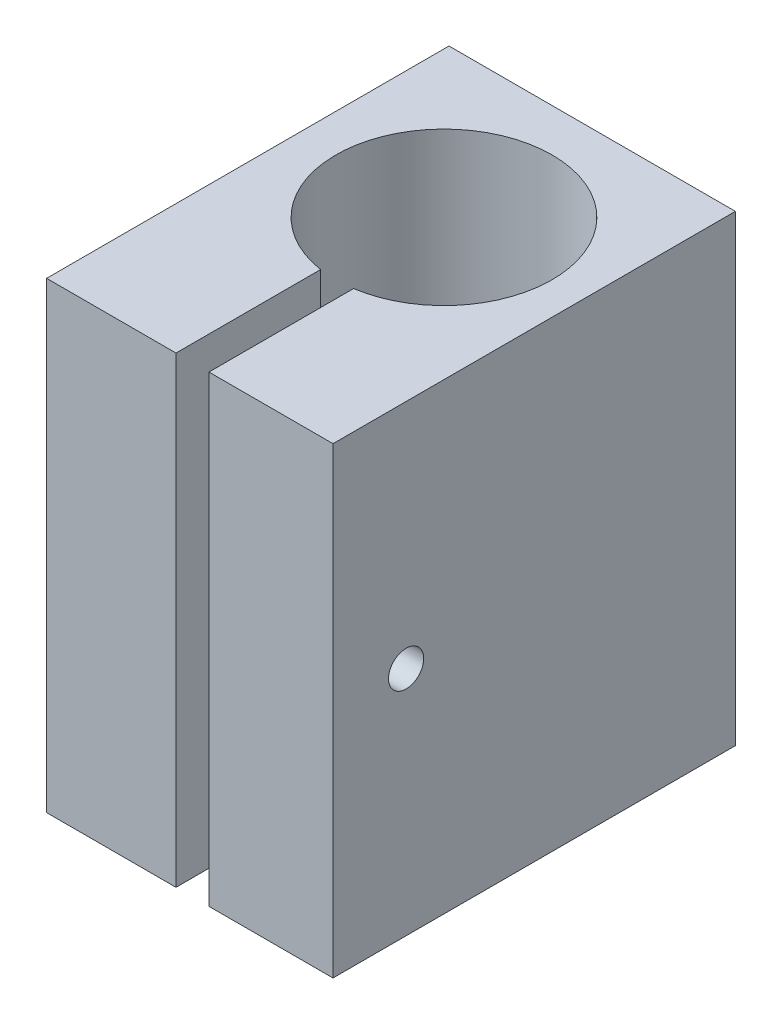
ISO-10303-21;
HEADER;
FILE_DESCRIPTION(('STEP AP214'),'2;1');
FILE_NAME('part.step','',(''),(''),'','','');
FILE_SCHEMA(('AUTOMOTIVE_DESIGN { 1 0 10303 214 1 1 1 1 }'));
ENDSEC;
DATA;
#1=APPLICATION_CONTEXT('core data for automotive mechanical design processes');
#2=APPLICATION_PROTOCOL_DEFINITION('international standard','automotive_design',2000,#1);
#3=PRODUCT_CONTEXT('',#1,'mechanical');
#4=PRODUCT('Part','Part','',(#3));
#5=PRODUCT_RELATED_PRODUCT_CATEGORY('part','',(#4));
#6=PRODUCT_DEFINITION_FORMATION('','',#4);
#7=PRODUCT_DEFINITION_CONTEXT('part definition',#1,'design');
#8=PRODUCT_DEFINITION('design','',#6,#7);
#9=PRODUCT_DEFINITION_SHAPE('','',#8);
#10=(LENGTH_UNIT() NAMED_UNIT(*) SI_UNIT(.MILLI.,.METRE.));
#11=(NAMED_UNIT(*) PLANE_ANGLE_UNIT() SI_UNIT($,.RADIAN.));
#12=(NAMED_UNIT(*) SI_UNIT($,.STERADIAN.) SOLID_ANGLE_UNIT());
#13=UNCERTAINTY_MEASURE_WITH_UNIT(LENGTH_MEASURE(1.E-05),#10,'distance_accuracy_value','');
#14=(GEOMETRIC_REPRESENTATION_CONTEXT(3) GLOBAL_UNCERTAINTY_ASSIGNED_CONTEXT((#13)) GLOBAL_UNIT_ASSIGNED_CONTEXT((#10,
#11,#12)) REPRESENTATION_CONTEXT('',''));
#15=CARTESIAN_POINT('',(0.,0.,0.));
#16=DIRECTION('',(0.,0.,1.));
#17=DIRECTION('',(1.,0.,0.));
#18=AXIS2_PLACEMENT_3D('',#15,#16,#17);
#19=CARTESIAN_POINT('',(1.90309523809524,46.,20.));
#20=DIRECTION('',(0.,0.,-1.));
#21=DIRECTION('',(-1.,0.,0.));
#22=AXIS2_PLACEMENT_3D('',#19,#20,#21);
#23=PLANE('',#22);
#24=DIRECTION('',(1.,0.,0.));
#25=VECTOR('',#24,1.);
#26=CARTESIAN_POINT('',(1.90309523809524,0.,20.));
#27=LINE('',#26,#25);
#28=CARTESIAN_POINT('',(1.90309523809524,0.,20.));
#29=VERTEX_POINT('',#28);
#30=CARTESIAN_POINT('',(14.235,0.,20.));
#31=VERTEX_POINT('',#30);
#32=EDGE_CURVE('E146',#29,#31,#27,.T.);
#33=ORIENTED_EDGE('',*,*,#32,.T.);
#34=DIRECTION('',(0.,-1.,0.));
#35=VECTOR('',#34,1.);
#36=CARTESIAN_POINT('',(14.235,46.,20.));
#37=LINE('',#36,#35);
#38=CARTESIAN_POINT('',(14.235,46.,20.));
#39=VERTEX_POINT('',#38);
#40=EDGE_CURVE('E11',#39,#31,#37,.T.);
#41=ORIENTED_EDGE('',*,*,#40,.F.);
#42=DIRECTION('',(1.,0.,0.));
#43=VECTOR('',#42,1.);
#44=CARTESIAN_POINT('',(1.90309523809524,46.,20.));
#45=LINE('',#44,#43);
#46=CARTESIAN_POINT('',(1.90309523809524,46.,20.));
#47=VERTEX_POINT('',#46);
#48=EDGE_CURVE('E162',#47,#39,#45,.T.);
#49=ORIENTED_EDGE('',*,*,#48,.F.);
#50=DIRECTION('',(0.,-1.,0.));
#51=VECTOR('',#50,1.);
#52=CARTESIAN_POINT('',(1.90309523809524,46.,20.));
#53=LINE('',#52,#51);
#54=EDGE_CURVE('E142',#47,#29,#53,.T.);
#55=ORIENTED_EDGE('',*,*,#54,.T.);
#56=EDGE_LOOP('',(#33,#41,#49,#55));
#57=FACE_BOUND('',#56,.T.);
#58=ADVANCED_FACE('F37',(#57),#23,.F.);
#59=CARTESIAN_POINT('',(14.235,46.,-20.));
#60=DIRECTION('',(-1.,0.,0.));
#61=DIRECTION('',(0.,0.,1.));
#62=AXIS2_PLACEMENT_3D('',#59,#60,#61);
#63=PLANE('',#62);
#64=CARTESIAN_POINT('',(14.235,23.,12.7330134340511));
#65=DIRECTION('',(-1.,0.,0.));
#66=DIRECTION('',(0.,0.,1.));
#67=AXIS2_PLACEMENT_3D('',#64,#65,#66);
#68=CIRCLE('',#67,1.75);
#69=CARTESIAN_POINT('',(14.235,23.,14.4830134340511));
#70=VERTEX_POINT('',#69);
#71=EDGE_CURVE('E251',#70,#70,#68,.T.);
#72=ORIENTED_EDGE('',*,*,#71,.T.);
#73=EDGE_LOOP('',(#72));
#74=FACE_BOUND('',#73,.T.);
#75=DIRECTION('',(0.,0.,-1.));
#76=VECTOR('',#75,1.);
#77=CARTESIAN_POINT('',(14.235,0.,-20.));
#78=LINE('',#77,#76);
#79=CARTESIAN_POINT('',(14.235,0.,-20.));
#80=VERTEX_POINT('',#79);
#81=EDGE_CURVE('E149',#31,#80,#78,.T.);
#82=ORIENTED_EDGE('',*,*,#81,.T.);
#83=DIRECTION('',(0.,-1.,0.));
#84=VECTOR('',#83,1.);
#85=CARTESIAN_POINT('',(14.235,46.,-20.));
#86=LINE('',#85,#84);
#87=CARTESIAN_POINT('',(14.235,46.,-20.));
#88=VERTEX_POINT('',#87);
#89=EDGE_CURVE('E45',#88,#80,#86,.T.);
#90=ORIENTED_EDGE('',*,*,#89,.F.);
#91=DIRECTION('',(0.,0.,-1.));
#92=VECTOR('',#91,1.);
#93=CARTESIAN_POINT('',(14.235,46.,-20.));
#94=LINE('',#93,#92);
#95=EDGE_CURVE('E102',#39,#88,#94,.T.);
#96=ORIENTED_EDGE('',*,*,#95,.F.);
#97=ORIENTED_EDGE('',*,*,#40,.T.);
#98=EDGE_LOOP('',(#82,#90,#96,#97));
#99=FACE_BOUND('',#98,.T.);
#100=ADVANCED_FACE('F275',(#74,#99),#63,.F.);
#101=CARTESIAN_POINT('',(-14.235,46.,-20.));
#102=DIRECTION('',(0.,0.,1.));
#103=DIRECTION('',(1.,0.,0.));
#104=AXIS2_PLACEMENT_3D('',#101,#102,#103);
#105=PLANE('',#104);
#106=DIRECTION('',(-1.,0.,0.));
#107=VECTOR('',#106,1.);
#108=CARTESIAN_POINT('',(-14.235,0.,-20.));
#109=LINE('',#108,#107);
#110=CARTESIAN_POINT('',(-14.235,0.,-20.));
#111=VERTEX_POINT('',#110);
#112=EDGE_CURVE('E152',#80,#111,#109,.T.);
#113=ORIENTED_EDGE('',*,*,#112,.T.);
#114=DIRECTION('',(0.,-1.,0.));
#115=VECTOR('',#114,1.);
#116=CARTESIAN_POINT('',(-14.235,46.,-20.));
#117=LINE('',#116,#115);
#118=CARTESIAN_POINT('',(-14.235,46.,-20.));
#119=VERTEX_POINT('',#118);
#120=EDGE_CURVE('E169',#119,#111,#117,.T.);
#121=ORIENTED_EDGE('',*,*,#120,.F.);
#122=DIRECTION('',(-1.,0.,0.));
#123=VECTOR('',#122,1.);
#124=CARTESIAN_POINT('',(-14.235,46.,-20.));
#125=LINE('',#124,#123);
#126=EDGE_CURVE('E178',#88,#119,#125,.T.);
#127=ORIENTED_EDGE('',*,*,#126,.F.);
#128=ORIENTED_EDGE('',*,*,#89,.T.);
#129=EDGE_LOOP('',(#113,#121,#127,#128));
#130=FACE_BOUND('',#129,.T.);
#131=ADVANCED_FACE('F176',(#130),#105,.F.);
#132=CARTESIAN_POINT('',(-14.235,46.,-20.));
#133=DIRECTION('',(1.,0.,0.));
#134=DIRECTION('',(0.,0.,-1.));
#135=AXIS2_PLACEMENT_3D('',#132,#133,#134);
#136=PLANE('',#135);
#137=DIRECTION('',(0.,0.5,0.866025403784438));
#138=VECTOR('',#137,1.);
#139=CARTESIAN_POINT('',(-14.235,19.75,12.7330134340511));
#140=LINE('',#139,#138);
#141=CARTESIAN_POINT('',(-14.235,19.75,12.7330134340511));
#142=VERTEX_POINT('',#141);
#143=CARTESIAN_POINT('',(-14.235,21.375,15.5475959963505));
#144=VERTEX_POINT('',#143);
#145=EDGE_CURVE('E225',#142,#144,#140,.T.);
#146=ORIENTED_EDGE('',*,*,#145,.F.);
#147=DIRECTION('',(0.,-0.500000000000001,0.866025403784438));
#148=VECTOR('',#147,1.);
#149=CARTESIAN_POINT('',(-14.235,21.375,9.91843087175167));
#150=LINE('',#149,#148);
#151=CARTESIAN_POINT('',(-14.235,21.375,9.91843087175167));
#152=VERTEX_POINT('',#151);
#153=EDGE_CURVE('E52',#152,#142,#150,.T.);
#154=ORIENTED_EDGE('',*,*,#153,.F.);
#155=DIRECTION('',(0.,-1.,0.));
#156=VECTOR('',#155,1.);
#157=CARTESIAN_POINT('',(-14.235,24.625,9.91843087175167));
#158=LINE('',#157,#156);
#159=CARTESIAN_POINT('',(-14.235,24.625,9.91843087175167));
#160=VERTEX_POINT('',#159);
#161=EDGE_CURVE('E212',#160,#152,#158,.T.);
#162=ORIENTED_EDGE('',*,*,#161,.F.);
#163=DIRECTION('',(0.,-0.5,-0.866025403784439));
#164=VECTOR('',#163,1.);
#165=CARTESIAN_POINT('',(-14.235,26.25,12.7330134340511));
#166=LINE('',#165,#164);
#167=CARTESIAN_POINT('',(-14.235,26.25,12.7330134340511));
#168=VERTEX_POINT('',#167);
#169=EDGE_CURVE('E216',#168,#160,#166,.T.);
#170=ORIENTED_EDGE('',*,*,#169,.F.);
#171=DIRECTION('',(0.,0.5,-0.866025403784438));
#172=VECTOR('',#171,1.);
#173=CARTESIAN_POINT('',(-14.235,24.625,15.5475959963505));
#174=LINE('',#173,#172);
#175=CARTESIAN_POINT('',(-14.235,24.625,15.5475959963505));
#176=VERTEX_POINT('',#175);
#177=EDGE_CURVE('E219',#176,#168,#174,.T.);
#178=ORIENTED_EDGE('',*,*,#177,.F.);
#179=DIRECTION('',(0.,1.,0.));
#180=VECTOR('',#179,1.);
#181=CARTESIAN_POINT('',(-14.235,21.375,15.5475959963505));
#182=LINE('',#181,#180);
#183=EDGE_CURVE('E222',#144,#176,#182,.T.);
#184=ORIENTED_EDGE('',*,*,#183,.F.);
#185=EDGE_LOOP('',(#146,#154,#162,#170,#178,#184));
#186=FACE_BOUND('',#185,.T.);
#187=DIRECTION('',(0.,0.,1.));
#188=VECTOR('',#187,1.);
#189=CARTESIAN_POINT('',(-14.235,0.,-20.));
#190=LINE('',#189,#188);
#191=CARTESIAN_POINT('',(-14.235,0.,20.));
#192=VERTEX_POINT('',#191);
#193=EDGE_CURVE('E154',#111,#192,#190,.T.);
#194=ORIENTED_EDGE('',*,*,#193,.T.);
#195=DIRECTION('',(0.,-1.,0.));
#196=VECTOR('',#195,1.);
#197=CARTESIAN_POINT('',(-14.235,46.,20.));
#198=LINE('',#197,#196);
#199=CARTESIAN_POINT('',(-14.235,46.,20.));
#200=VERTEX_POINT('',#199);
#201=EDGE_CURVE('E166',#200,#192,#198,.T.);
#202=ORIENTED_EDGE('',*,*,#201,.F.);
#203=DIRECTION('',(0.,0.,1.));
#204=VECTOR('',#203,1.);
#205=CARTESIAN_POINT('',(-14.235,46.,-20.));
#206=LINE('',#205,#204);
#207=EDGE_CURVE('E190',#119,#200,#206,.T.);
#208=ORIENTED_EDGE('',*,*,#207,.F.);
#209=ORIENTED_EDGE('',*,*,#120,.T.);
#210=EDGE_LOOP('',(#194,#202,#208,#209));
#211=FACE_BOUND('',#210,.T.);
#212=ADVANCED_FACE('F186',(#186,#211),#136,.F.);
#213=CARTESIAN_POINT('',(-14.235,46.,20.));
#214=DIRECTION('',(0.,0.,-1.));
#215=DIRECTION('',(-1.,0.,0.));
#216=AXIS2_PLACEMENT_3D('',#213,#214,#215);
#217=PLANE('',#216);
#218=DIRECTION('',(1.,0.,0.));
#219=VECTOR('',#218,1.);
#220=CARTESIAN_POINT('',(-14.235,0.,20.));
#221=LINE('',#220,#219);
#222=CARTESIAN_POINT('',(-1.37309523809524,0.,20.));
#223=VERTEX_POINT('',#222);
#224=EDGE_CURVE('E156',#192,#223,#221,.T.);
#225=ORIENTED_EDGE('',*,*,#224,.T.);
#226=DIRECTION('',(0.,-1.,0.));
#227=VECTOR('',#226,1.);
#228=CARTESIAN_POINT('',(-1.37309523809524,46.,20.));
#229=LINE('',#228,#227);
#230=CARTESIAN_POINT('',(-1.37309523809524,46.,20.));
#231=VERTEX_POINT('',#230);
#232=EDGE_CURVE('E137',#231,#223,#229,.T.);
#233=ORIENTED_EDGE('',*,*,#232,.F.);
#234=DIRECTION('',(1.,0.,0.));
#235=VECTOR('',#234,1.);
#236=CARTESIAN_POINT('',(-14.235,46.,20.));
#237=LINE('',#236,#235);
#238=EDGE_CURVE('E125',#200,#231,#237,.T.);
#239=ORIENTED_EDGE('',*,*,#238,.F.);
#240=ORIENTED_EDGE('',*,*,#201,.T.);
#241=EDGE_LOOP('',(#225,#233,#239,#240));
#242=FACE_BOUND('',#241,.T.);
#243=ADVANCED_FACE('F189',(#242),#217,.F.);
#244=CARTESIAN_POINT('',(-1.37309523809524,46.,20.));
#245=DIRECTION('',(-1.,0.,0.));
#246=DIRECTION('',(0.,0.,1.));
#247=AXIS2_PLACEMENT_3D('',#244,#245,#246);
#248=PLANE('',#247);
#249=CARTESIAN_POINT('',(-1.37309523809524,23.,12.7330134340511));
#250=DIRECTION('',(-1.,0.,0.));
#251=DIRECTION('',(0.,0.,1.));
#252=AXIS2_PLACEMENT_3D('',#249,#250,#251);
#253=CIRCLE('',#252,1.75);
#254=CARTESIAN_POINT('',(-1.37309523809524,23.,14.4830134340511));
#255=VERTEX_POINT('',#254);
#256=EDGE_CURVE('E229',#255,#255,#253,.T.);
#257=ORIENTED_EDGE('',*,*,#256,.T.);
#258=EDGE_LOOP('',(#257));
#259=FACE_BOUND('',#258,.T.);
#260=DIRECTION('',(0.,0.,-1.));
#261=VECTOR('',#260,1.);
#262=CARTESIAN_POINT('',(-1.37309523809524,0.,20.));
#263=LINE('',#262,#261);
#264=CARTESIAN_POINT('',(-1.37309523809524,0.,5.62445970348278));
#265=VERTEX_POINT('',#264);
#266=EDGE_CURVE('E134',#223,#265,#263,.T.);
#267=ORIENTED_EDGE('',*,*,#266,.T.);
#268=DIRECTION('',(0.,-1.,0.));
#269=VECTOR('',#268,1.);
#270=CARTESIAN_POINT('',(-1.37309523809524,46.,5.62445970348278));
#271=LINE('',#270,#269);
#272=CARTESIAN_POINT('',(-1.37309523809524,46.,5.62445970348278));
#273=VERTEX_POINT('',#272);
#274=EDGE_CURVE('E131',#273,#265,#271,.T.);
#275=ORIENTED_EDGE('',*,*,#274,.F.);
#276=DIRECTION('',(0.,0.,-1.));
#277=VECTOR('',#276,1.);
#278=CARTESIAN_POINT('',(-1.37309523809524,46.,20.));
#279=LINE('',#278,#277);
#280=EDGE_CURVE('E118',#231,#273,#279,.T.);
#281=ORIENTED_EDGE('',*,*,#280,.F.);
#282=ORIENTED_EDGE('',*,*,#232,.T.);
#283=EDGE_LOOP('',(#267,#275,#281,#282));
#284=FACE_BOUND('',#283,.T.);
#285=ADVANCED_FACE('F132',(#259,#284),#248,.F.);
#286=CARTESIAN_POINT('',(0.264999999999999,46.,-5.00000000000001));
#287=DIRECTION('',(0.,-1.,0.));
#288=DIRECTION('',(0.,0.,-1.));
#289=AXIS2_PLACEMENT_3D('',#286,#287,#288);
#290=CYLINDRICAL_SURFACE('',#289,10.75);
#291=CARTESIAN_POINT('',(0.264999999999999,0.,-5.00000000000001));
#292=DIRECTION('',(0.,-1.,0.));
#293=DIRECTION('',(0.,0.,1.));
#294=AXIS2_PLACEMENT_3D('',#291,#292,#293);
#295=CIRCLE('',#294,10.75);
#296=CARTESIAN_POINT('',(1.90309523809524,0.,5.62445970348278));
#297=VERTEX_POINT('',#296);
#298=EDGE_CURVE('E159',#265,#297,#295,.T.);
#299=ORIENTED_EDGE('',*,*,#298,.T.);
#300=DIRECTION('',(0.,-1.,0.));
#301=VECTOR('',#300,1.);
#302=CARTESIAN_POINT('',(1.90309523809524,46.,5.62445970348278));
#303=LINE('',#302,#301);
#304=CARTESIAN_POINT('',(1.90309523809524,46.,5.62445970348278));
#305=VERTEX_POINT('',#304);
#306=EDGE_CURVE('E138',#305,#297,#303,.T.);
#307=ORIENTED_EDGE('',*,*,#306,.F.);
#308=CARTESIAN_POINT('',(0.264999999999999,46.,-5.00000000000001));
#309=DIRECTION('',(0.,-1.,0.));
#310=DIRECTION('',(0.,0.,1.));
#311=AXIS2_PLACEMENT_3D('',#308,#309,#310);
#312=CIRCLE('',#311,10.75);
#313=EDGE_CURVE('E122',#273,#305,#312,.T.);
#314=ORIENTED_EDGE('',*,*,#313,.F.);
#315=ORIENTED_EDGE('',*,*,#274,.T.);
#316=EDGE_LOOP('',(#299,#307,#314,#315));
#317=FACE_BOUND('',#316,.T.);
#318=ADVANCED_FACE('F140',(#317),#290,.F.);
#319=CARTESIAN_POINT('',(1.90309523809524,46.,20.));
#320=DIRECTION('',(1.,0.,0.));
#321=DIRECTION('',(0.,0.,-1.));
#322=AXIS2_PLACEMENT_3D('',#319,#320,#321);
#323=PLANE('',#322);
#324=CARTESIAN_POINT('',(1.90309523809524,23.,12.7330134340511));
#325=DIRECTION('',(1.,0.,0.));
#326=DIRECTION('',(0.,0.,-1.));
#327=AXIS2_PLACEMENT_3D('',#324,#325,#326);
#328=CIRCLE('',#327,1.75);
#329=CARTESIAN_POINT('',(1.90309523809524,23.,10.9830134340511));
#330=VERTEX_POINT('',#329);
#331=EDGE_CURVE('E40',#330,#330,#328,.T.);
#332=ORIENTED_EDGE('',*,*,#331,.T.);
#333=EDGE_LOOP('',(#332));
#334=FACE_BOUND('',#333,.T.);
#335=DIRECTION('',(0.,0.,1.));
#336=VECTOR('',#335,1.);
#337=CARTESIAN_POINT('',(1.90309523809524,0.,20.));
#338=LINE('',#337,#336);
#339=EDGE_CURVE('E94',#297,#29,#338,.T.);
#340=ORIENTED_EDGE('',*,*,#339,.T.);
#341=ORIENTED_EDGE('',*,*,#54,.F.);
#342=DIRECTION('',(0.,0.,1.));
#343=VECTOR('',#342,1.);
#344=CARTESIAN_POINT('',(1.90309523809524,46.,20.));
#345=LINE('',#344,#343);
#346=EDGE_CURVE('E61',#305,#47,#345,.T.);
#347=ORIENTED_EDGE('',*,*,#346,.F.);
#348=ORIENTED_EDGE('',*,*,#306,.T.);
#349=EDGE_LOOP('',(#340,#341,#347,#348));
#350=FACE_BOUND('',#349,.T.);
#351=ADVANCED_FACE('F258',(#334,#350),#323,.F.);
#352=CARTESIAN_POINT('',(0.264999999999999,46.,-5.00000000000001));
#353=DIRECTION('',(0.,1.,0.));
#354=DIRECTION('',(0.,0.,1.));
#355=AXIS2_PLACEMENT_3D('',#352,#353,#354);
#356=PLANE('',#355);
#357=ORIENTED_EDGE('',*,*,#48,.T.);
#358=ORIENTED_EDGE('',*,*,#95,.T.);
#359=ORIENTED_EDGE('',*,*,#126,.T.);
#360=ORIENTED_EDGE('',*,*,#207,.T.);
#361=ORIENTED_EDGE('',*,*,#238,.T.);
#362=ORIENTED_EDGE('',*,*,#280,.T.);
#363=ORIENTED_EDGE('',*,*,#313,.T.);
#364=ORIENTED_EDGE('',*,*,#346,.T.);
#365=EDGE_LOOP('',(#357,#358,#359,#360,#361,#362,#363,#364));
#366=FACE_BOUND('',#365,.T.);
#367=ADVANCED_FACE('F120',(#366),#356,.T.);
#368=CARTESIAN_POINT('',(0.264999999999999,0.,-5.00000000000001));
#369=DIRECTION('',(0.,1.,0.));
#370=DIRECTION('',(0.,0.,1.));
#371=AXIS2_PLACEMENT_3D('',#368,#369,#370);
#372=PLANE('',#371);
#373=ORIENTED_EDGE('',*,*,#32,.F.);
#374=ORIENTED_EDGE('',*,*,#339,.F.);
#375=ORIENTED_EDGE('',*,*,#298,.F.);
#376=ORIENTED_EDGE('',*,*,#266,.F.);
#377=ORIENTED_EDGE('',*,*,#224,.F.);
#378=ORIENTED_EDGE('',*,*,#193,.F.);
#379=ORIENTED_EDGE('',*,*,#112,.F.);
#380=ORIENTED_EDGE('',*,*,#81,.F.);
#381=EDGE_LOOP('',(#373,#374,#375,#376,#377,#378,#379,#380));
#382=FACE_BOUND('',#381,.T.);
#383=ADVANCED_FACE('F182',(#382),#372,.F.);
#384=CARTESIAN_POINT('',(-11.235,21.375,9.91843087175167));
#385=DIRECTION('',(0.,-0.866025403784438,-0.500000000000001));
#386=DIRECTION('',(0.,0.500000000000001,-0.866025403784438));
#387=AXIS2_PLACEMENT_3D('',#384,#385,#386);
#388=PLANE('',#387);
#389=ORIENTED_EDGE('',*,*,#153,.T.);
#390=DIRECTION('',(-1.,0.,0.));
#391=VECTOR('',#390,1.);
#392=CARTESIAN_POINT('',(-11.235,19.75,12.7330134340511));
#393=LINE('',#392,#391);
#394=CARTESIAN_POINT('',(-11.235,19.75,12.7330134340511));
#395=VERTEX_POINT('',#394);
#396=EDGE_CURVE('E196',#395,#142,#393,.T.);
#397=ORIENTED_EDGE('',*,*,#396,.F.);
#398=DIRECTION('',(0.,-0.500000000000001,0.866025403784438));
#399=VECTOR('',#398,1.);
#400=CARTESIAN_POINT('',(-11.235,21.375,9.91843087175167));
#401=LINE('',#400,#399);
#402=CARTESIAN_POINT('',(-11.235,21.375,9.91843087175167));
#403=VERTEX_POINT('',#402);
#404=EDGE_CURVE('E215',#403,#395,#401,.T.);
#405=ORIENTED_EDGE('',*,*,#404,.F.);
#406=DIRECTION('',(-1.,0.,0.));
#407=VECTOR('',#406,1.);
#408=CARTESIAN_POINT('',(-11.235,21.375,9.91843087175167));
#409=LINE('',#408,#407);
#410=EDGE_CURVE('E150',#403,#152,#409,.T.);
#411=ORIENTED_EDGE('',*,*,#410,.T.);
#412=EDGE_LOOP('',(#389,#397,#405,#411));
#413=FACE_BOUND('',#412,.T.);
#414=ADVANCED_FACE('F337',(#413),#388,.F.);
#415=CARTESIAN_POINT('',(-11.235,24.625,9.91843087175167));
#416=DIRECTION('',(0.,0.,-1.));
#417=DIRECTION('',(-1.,0.,0.));
#418=AXIS2_PLACEMENT_3D('',#415,#416,#417);
#419=PLANE('',#418);
#420=ORIENTED_EDGE('',*,*,#161,.T.);
#421=ORIENTED_EDGE('',*,*,#410,.F.);
#422=DIRECTION('',(0.,-1.,0.));
#423=VECTOR('',#422,1.);
#424=CARTESIAN_POINT('',(-11.235,24.625,9.91843087175167));
#425=LINE('',#424,#423);
#426=CARTESIAN_POINT('',(-11.235,24.625,9.91843087175167));
#427=VERTEX_POINT('',#426);
#428=EDGE_CURVE('E199',#427,#403,#425,.T.);
#429=ORIENTED_EDGE('',*,*,#428,.F.);
#430=DIRECTION('',(-1.,0.,0.));
#431=VECTOR('',#430,1.);
#432=CARTESIAN_POINT('',(-11.235,24.625,9.91843087175167));
#433=LINE('',#432,#431);
#434=EDGE_CURVE('E208',#427,#160,#433,.T.);
#435=ORIENTED_EDGE('',*,*,#434,.T.);
#436=EDGE_LOOP('',(#420,#421,#429,#435));
#437=FACE_BOUND('',#436,.T.);
#438=ADVANCED_FACE('F345',(#437),#419,.F.);
#439=CARTESIAN_POINT('',(-11.235,26.25,12.7330134340511));
#440=DIRECTION('',(0.,0.866025403784439,-0.5));
#441=DIRECTION('',(0.,0.5,0.866025403784439));
#442=AXIS2_PLACEMENT_3D('',#439,#440,#441);
#443=PLANE('',#442);
#444=ORIENTED_EDGE('',*,*,#169,.T.);
#445=ORIENTED_EDGE('',*,*,#434,.F.);
#446=DIRECTION('',(0.,-0.5,-0.866025403784439));
#447=VECTOR('',#446,1.);
#448=CARTESIAN_POINT('',(-11.235,26.25,12.7330134340511));
#449=LINE('',#448,#447);
#450=CARTESIAN_POINT('',(-11.235,26.25,12.7330134340511));
#451=VERTEX_POINT('',#450);
#452=EDGE_CURVE('E232',#451,#427,#449,.T.);
#453=ORIENTED_EDGE('',*,*,#452,.F.);
#454=DIRECTION('',(-1.,0.,0.));
#455=VECTOR('',#454,1.);
#456=CARTESIAN_POINT('',(-11.235,26.25,12.7330134340511));
#457=LINE('',#456,#455);
#458=EDGE_CURVE('E205',#451,#168,#457,.T.);
#459=ORIENTED_EDGE('',*,*,#458,.T.);
#460=EDGE_LOOP('',(#444,#445,#453,#459));
#461=FACE_BOUND('',#460,.T.);
#462=ADVANCED_FACE('F351',(#461),#443,.F.);
#463=CARTESIAN_POINT('',(-11.235,24.625,15.5475959963505));
#464=DIRECTION('',(0.,0.866025403784438,0.5));
#465=DIRECTION('',(0.,-0.5,0.866025403784438));
#466=AXIS2_PLACEMENT_3D('',#463,#464,#465);
#467=PLANE('',#466);
#468=ORIENTED_EDGE('',*,*,#177,.T.);
#469=ORIENTED_EDGE('',*,*,#458,.F.);
#470=DIRECTION('',(0.,0.5,-0.866025403784438));
#471=VECTOR('',#470,1.);
#472=CARTESIAN_POINT('',(-11.235,24.625,15.5475959963505));
#473=LINE('',#472,#471);
#474=CARTESIAN_POINT('',(-11.235,24.625,15.5475959963505));
#475=VERTEX_POINT('',#474);
#476=EDGE_CURVE('E235',#475,#451,#473,.T.);
#477=ORIENTED_EDGE('',*,*,#476,.F.);
#478=DIRECTION('',(-1.,0.,0.));
#479=VECTOR('',#478,1.);
#480=CARTESIAN_POINT('',(-11.235,24.625,15.5475959963505));
#481=LINE('',#480,#479);
#482=EDGE_CURVE('E202',#475,#176,#481,.T.);
#483=ORIENTED_EDGE('',*,*,#482,.T.);
#484=EDGE_LOOP('',(#468,#469,#477,#483));
#485=FACE_BOUND('',#484,.T.);
#486=ADVANCED_FACE('F359',(#485),#467,.F.);
#487=CARTESIAN_POINT('',(-11.235,21.375,15.5475959963505));
#488=DIRECTION('',(0.,0.,1.));
#489=DIRECTION('',(1.,0.,0.));
#490=AXIS2_PLACEMENT_3D('',#487,#488,#489);
#491=PLANE('',#490);
#492=ORIENTED_EDGE('',*,*,#183,.T.);
#493=ORIENTED_EDGE('',*,*,#482,.F.);
#494=DIRECTION('',(0.,1.,0.));
#495=VECTOR('',#494,1.);
#496=CARTESIAN_POINT('',(-11.235,21.375,15.5475959963505));
#497=LINE('',#496,#495);
#498=CARTESIAN_POINT('',(-11.235,21.375,15.5475959963505));
#499=VERTEX_POINT('',#498);
#500=EDGE_CURVE('E238',#499,#475,#497,.T.);
#501=ORIENTED_EDGE('',*,*,#500,.F.);
#502=DIRECTION('',(-1.,0.,0.));
#503=VECTOR('',#502,1.);
#504=CARTESIAN_POINT('',(-11.235,21.375,15.5475959963505));
#505=LINE('',#504,#503);
#506=EDGE_CURVE('E198',#499,#144,#505,.T.);
#507=ORIENTED_EDGE('',*,*,#506,.T.);
#508=EDGE_LOOP('',(#492,#493,#501,#507));
#509=FACE_BOUND('',#508,.T.);
#510=ADVANCED_FACE('F367',(#509),#491,.F.);
#511=CARTESIAN_POINT('',(-11.235,19.75,12.7330134340511));
#512=DIRECTION('',(0.,-0.866025403784438,0.5));
#513=DIRECTION('',(0.,-0.5,-0.866025403784438));
#514=AXIS2_PLACEMENT_3D('',#511,#512,#513);
#515=PLANE('',#514);
#516=ORIENTED_EDGE('',*,*,#145,.T.);
#517=ORIENTED_EDGE('',*,*,#506,.F.);
#518=DIRECTION('',(0.,0.5,0.866025403784438));
#519=VECTOR('',#518,1.);
#520=CARTESIAN_POINT('',(-11.235,19.75,12.7330134340511));
#521=LINE('',#520,#519);
#522=EDGE_CURVE('E241',#395,#499,#521,.T.);
#523=ORIENTED_EDGE('',*,*,#522,.F.);
#524=ORIENTED_EDGE('',*,*,#396,.T.);
#525=EDGE_LOOP('',(#516,#517,#523,#524));
#526=FACE_BOUND('',#525,.T.);
#527=ADVANCED_FACE('F271',(#526),#515,.F.);
#528=CARTESIAN_POINT('',(-11.235,0.,0.));
#529=DIRECTION('',(-1.,0.,0.));
#530=DIRECTION('',(0.,-1.,0.));
#531=AXIS2_PLACEMENT_3D('',#528,#529,#530);
#532=PLANE('',#531);
#533=CARTESIAN_POINT('',(-11.235,23.,12.7330134340511));
#534=DIRECTION('',(-1.,0.,0.));
#535=DIRECTION('',(0.,0.,1.));
#536=AXIS2_PLACEMENT_3D('',#533,#534,#535);
#537=CIRCLE('',#536,1.75);
#538=CARTESIAN_POINT('',(-11.235,23.,14.4830134340511));
#539=VERTEX_POINT('',#538);
#540=EDGE_CURVE('E248',#539,#539,#537,.T.);
#541=ORIENTED_EDGE('',*,*,#540,.F.);
#542=EDGE_LOOP('',(#541));
#543=FACE_BOUND('',#542,.T.);
#544=ORIENTED_EDGE('',*,*,#404,.T.);
#545=ORIENTED_EDGE('',*,*,#522,.T.);
#546=ORIENTED_EDGE('',*,*,#500,.T.);
#547=ORIENTED_EDGE('',*,*,#476,.T.);
#548=ORIENTED_EDGE('',*,*,#452,.T.);
#549=ORIENTED_EDGE('',*,*,#428,.T.);
#550=EDGE_LOOP('',(#544,#545,#546,#547,#548,#549));
#551=FACE_BOUND('',#550,.T.);
#552=ADVANCED_FACE('F263',(#543,#551),#532,.T.);
#553=CARTESIAN_POINT('',(14.235,23.,12.7330134340511));
#554=DIRECTION('',(-1.,0.,0.));
#555=DIRECTION('',(0.,0.,1.));
#556=AXIS2_PLACEMENT_3D('',#553,#554,#555);
#557=CYLINDRICAL_SURFACE('',#556,1.75);
#558=ORIENTED_EDGE('',*,*,#71,.F.);
#559=EDGE_LOOP('',(#558));
#560=FACE_BOUND('',#559,.T.);
#561=ORIENTED_EDGE('',*,*,#331,.F.);
#562=EDGE_LOOP('',(#561));
#563=FACE_BOUND('',#562,.T.);
#564=ADVANCED_FACE('F260',(#560,#563),#557,.F.);
#565=ORIENTED_EDGE('',*,*,#540,.T.);
#566=EDGE_LOOP('',(#565));
#567=FACE_BOUND('',#566,.T.);
#568=ORIENTED_EDGE('',*,*,#256,.F.);
#569=EDGE_LOOP('',(#568));
#570=FACE_BOUND('',#569,.T.);
#571=ADVANCED_FACE('F262',(#567,#570),#557,.F.);
#572=CLOSED_SHELL('',(#58,#100,#131,#212,#243,#285,#318,#351,#367,#383,#414,#438,#462,#486,#510,
#527,#552,#564,#571));
#573=MANIFOLD_SOLID_BREP('B2',#572);
#574=ADVANCED_BREP_SHAPE_REPRESENTATION('',(#18,#573),#14);
#575=SHAPE_DEFINITION_REPRESENTATION(#9,#574);
ENDSEC;
END-ISO-10303-21;
